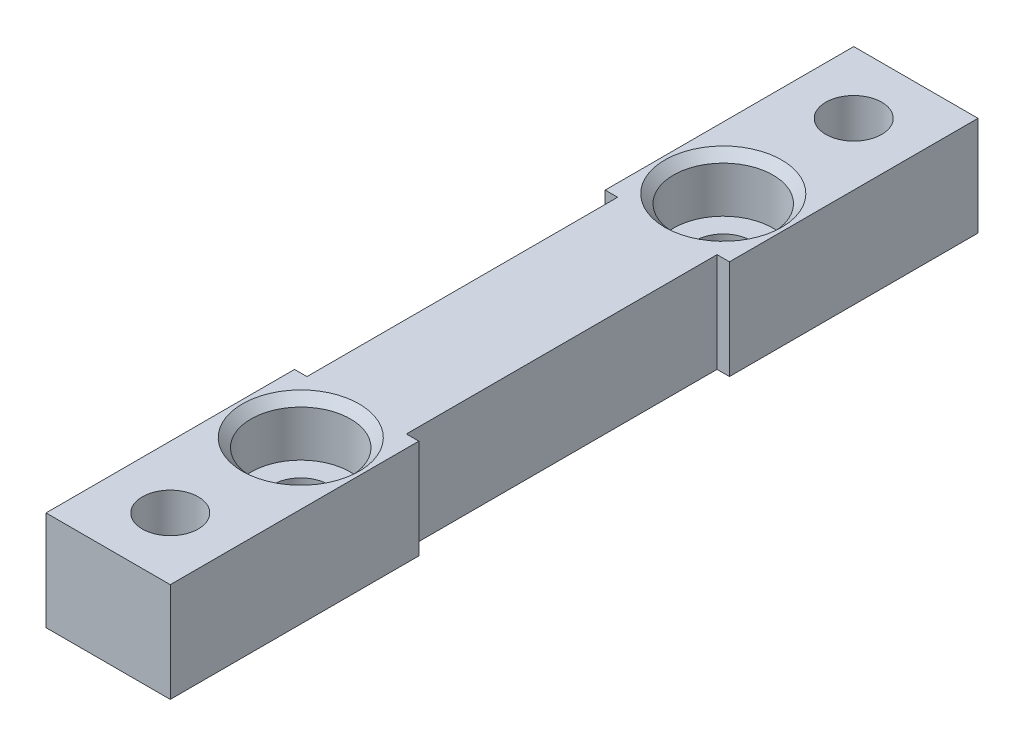
ISO-10303-21;
HEADER;
FILE_DESCRIPTION(('STEP AP214'),'2;1');
FILE_NAME('part.step','',(''),(''),'','','');
FILE_SCHEMA(('AUTOMOTIVE_DESIGN { 1 0 10303 214 1 1 1 1 }'));
ENDSEC;
DATA;
#1=APPLICATION_CONTEXT('core data for automotive mechanical design processes');
#2=APPLICATION_PROTOCOL_DEFINITION('international standard','automotive_design',2000,#1);
#3=PRODUCT_CONTEXT('',#1,'mechanical');
#4=PRODUCT('Part','Part','',(#3));
#5=PRODUCT_RELATED_PRODUCT_CATEGORY('part','',(#4));
#6=PRODUCT_DEFINITION_FORMATION('','',#4);
#7=PRODUCT_DEFINITION_CONTEXT('part definition',#1,'design');
#8=PRODUCT_DEFINITION('design','',#6,#7);
#9=PRODUCT_DEFINITION_SHAPE('','',#8);
#10=(LENGTH_UNIT() NAMED_UNIT(*) SI_UNIT(.MILLI.,.METRE.));
#11=(NAMED_UNIT(*) PLANE_ANGLE_UNIT() SI_UNIT($,.RADIAN.));
#12=(NAMED_UNIT(*) SI_UNIT($,.STERADIAN.) SOLID_ANGLE_UNIT());
#13=UNCERTAINTY_MEASURE_WITH_UNIT(LENGTH_MEASURE(1.E-05),#10,'distance_accuracy_value','');
#14=(GEOMETRIC_REPRESENTATION_CONTEXT(3) GLOBAL_UNCERTAINTY_ASSIGNED_CONTEXT((#13)) GLOBAL_UNIT_ASSIGNED_CONTEXT((#10,
#11,#12)) REPRESENTATION_CONTEXT('',''));
#15=CARTESIAN_POINT('',(0.,0.,0.));
#16=DIRECTION('',(0.,0.,1.));
#17=DIRECTION('',(1.,0.,0.));
#18=AXIS2_PLACEMENT_3D('',#15,#16,#17);
#19=CARTESIAN_POINT('',(0.,0.,0.));
#20=DIRECTION('',(0.,1.,0.));
#21=DIRECTION('',(0.,0.,1.));
#22=AXIS2_PLACEMENT_3D('',#19,#20,#21);
#23=PLANE('',#22);
#24=DIRECTION('',(-0.5,0.,0.866025403784438));
#25=VECTOR('',#24,1.);
#26=CARTESIAN_POINT('',(-8.83345911860128,0.,-5.10000000000001));
#27=LINE('',#26,#25);
#28=CARTESIAN_POINT('',(4.09918691124635,0.,-27.5));
#29=VERTEX_POINT('',#28);
#30=CARTESIAN_POINT('',(2.04959345562318,0.,-23.95));
#31=VERTEX_POINT('',#30);
#32=EDGE_CURVE('E231',#29,#31,#27,.T.);
#33=ORIENTED_EDGE('',*,*,#32,.F.);
#34=DIRECTION('',(0.5,0.,0.866025403784439));
#35=VECTOR('',#34,1.);
#36=CARTESIAN_POINT('',(14.9822394854708,0.,-8.65));
#37=LINE('',#36,#35);
#38=CARTESIAN_POINT('',(2.04959345562318,0.,-31.05));
#39=VERTEX_POINT('',#38);
#40=EDGE_CURVE('E49',#39,#29,#37,.T.);
#41=ORIENTED_EDGE('',*,*,#40,.F.);
#42=DIRECTION('',(1.,0.,0.));
#43=VECTOR('',#42,1.);
#44=CARTESIAN_POINT('',(0.,0.,-31.05));
#45=LINE('',#44,#43);
#46=CARTESIAN_POINT('',(-2.04959345562317,0.,-31.05));
#47=VERTEX_POINT('',#46);
#48=EDGE_CURVE('E220',#47,#39,#45,.T.);
#49=ORIENTED_EDGE('',*,*,#48,.F.);
#50=DIRECTION('',(0.5,0.,-0.866025403784438));
#51=VECTOR('',#50,1.);
#52=CARTESIAN_POINT('',(-14.9822394854708,0.,-8.65000000000001));
#53=LINE('',#52,#51);
#54=CARTESIAN_POINT('',(-4.09918691124634,0.,-27.5));
#55=VERTEX_POINT('',#54);
#56=EDGE_CURVE('E240',#55,#47,#53,.T.);
#57=ORIENTED_EDGE('',*,*,#56,.F.);
#58=DIRECTION('',(-0.5,0.,-0.866025403784439));
#59=VECTOR('',#58,1.);
#60=CARTESIAN_POINT('',(8.83345911860127,0.,-5.1));
#61=LINE('',#60,#59);
#62=CARTESIAN_POINT('',(-2.04959345562317,0.,-23.95));
#63=VERTEX_POINT('',#62);
#64=EDGE_CURVE('E237',#63,#55,#61,.T.);
#65=ORIENTED_EDGE('',*,*,#64,.F.);
#66=DIRECTION('',(-1.,0.,0.));
#67=VECTOR('',#66,1.);
#68=CARTESIAN_POINT('',(0.,0.,-23.95));
#69=LINE('',#68,#67);
#70=EDGE_CURVE('E234',#31,#63,#69,.T.);
#71=ORIENTED_EDGE('',*,*,#70,.F.);
#72=EDGE_LOOP('',(#33,#41,#49,#57,#65,#71));
#73=FACE_BOUND('',#72,.T.);
#74=DIRECTION('',(1.,0.,0.));
#75=VECTOR('',#74,1.);
#76=CARTESIAN_POINT('',(0.,0.,12.5));
#77=LINE('',#76,#75);
#78=CARTESIAN_POINT('',(4.,0.,12.5));
#79=VERTEX_POINT('',#78);
#80=CARTESIAN_POINT('',(5.00000000000001,0.,12.5));
#81=VERTEX_POINT('',#80);
#82=EDGE_CURVE('E333',#79,#81,#77,.T.);
#83=ORIENTED_EDGE('',*,*,#82,.T.);
#84=DIRECTION('',(0.,0.,-1.));
#85=VECTOR('',#84,1.);
#86=CARTESIAN_POINT('',(5.00000000000001,0.,0.));
#87=LINE('',#86,#85);
#88=CARTESIAN_POINT('',(5.,0.,32.5));
#89=VERTEX_POINT('',#88);
#90=EDGE_CURVE('E338',#89,#81,#87,.T.);
#91=ORIENTED_EDGE('',*,*,#90,.F.);
#92=DIRECTION('',(1.,0.,0.));
#93=VECTOR('',#92,1.);
#94=CARTESIAN_POINT('',(0.,0.,32.5));
#95=LINE('',#94,#93);
#96=CARTESIAN_POINT('',(-5.,0.,32.5));
#97=VERTEX_POINT('',#96);
#98=EDGE_CURVE('E387',#97,#89,#95,.T.);
#99=ORIENTED_EDGE('',*,*,#98,.F.);
#100=DIRECTION('',(0.,0.,-1.));
#101=VECTOR('',#100,1.);
#102=CARTESIAN_POINT('',(-5.,0.,0.));
#103=LINE('',#102,#101);
#104=CARTESIAN_POINT('',(-5.,0.,12.5));
#105=VERTEX_POINT('',#104);
#106=EDGE_CURVE('E384',#97,#105,#103,.T.);
#107=ORIENTED_EDGE('',*,*,#106,.T.);
#108=CARTESIAN_POINT('',(-4.,0.,12.5));
#109=VERTEX_POINT('',#108);
#110=EDGE_CURVE('E366',#105,#109,#77,.T.);
#111=ORIENTED_EDGE('',*,*,#110,.T.);
#112=DIRECTION('',(0.,0.,1.));
#113=VECTOR('',#112,1.);
#114=CARTESIAN_POINT('',(-4.,0.,0.));
#115=LINE('',#114,#113);
#116=CARTESIAN_POINT('',(-4.,0.,-12.5));
#117=VERTEX_POINT('',#116);
#118=EDGE_CURVE('E381',#117,#109,#115,.T.);
#119=ORIENTED_EDGE('',*,*,#118,.F.);
#120=DIRECTION('',(1.,0.,0.));
#121=VECTOR('',#120,1.);
#122=CARTESIAN_POINT('',(0.,0.,-12.5));
#123=LINE('',#122,#121);
#124=CARTESIAN_POINT('',(-5.,0.,-12.5));
#125=VERTEX_POINT('',#124);
#126=EDGE_CURVE('E373',#125,#117,#123,.T.);
#127=ORIENTED_EDGE('',*,*,#126,.F.);
#128=DIRECTION('',(0.,0.,1.));
#129=VECTOR('',#128,1.);
#130=CARTESIAN_POINT('',(-5.,0.,0.));
#131=LINE('',#130,#129);
#132=CARTESIAN_POINT('',(-5.,0.,-32.5));
#133=VERTEX_POINT('',#132);
#134=EDGE_CURVE('E379',#133,#125,#131,.T.);
#135=ORIENTED_EDGE('',*,*,#134,.F.);
#136=DIRECTION('',(1.,0.,0.));
#137=VECTOR('',#136,1.);
#138=CARTESIAN_POINT('',(0.,0.,-32.5));
#139=LINE('',#138,#137);
#140=CARTESIAN_POINT('',(5.,0.,-32.5));
#141=VERTEX_POINT('',#140);
#142=EDGE_CURVE('E376',#133,#141,#139,.T.);
#143=ORIENTED_EDGE('',*,*,#142,.T.);
#144=DIRECTION('',(0.,0.,1.));
#145=VECTOR('',#144,1.);
#146=CARTESIAN_POINT('',(5.00000000000001,0.,0.));
#147=LINE('',#146,#145);
#148=CARTESIAN_POINT('',(5.00000000000001,0.,-12.5));
#149=VERTEX_POINT('',#148);
#150=EDGE_CURVE('E372',#141,#149,#147,.T.);
#151=ORIENTED_EDGE('',*,*,#150,.T.);
#152=CARTESIAN_POINT('',(4.,0.,-12.5));
#153=VERTEX_POINT('',#152);
#154=EDGE_CURVE('E369',#153,#149,#123,.T.);
#155=ORIENTED_EDGE('',*,*,#154,.F.);
#156=DIRECTION('',(0.,0.,1.));
#157=VECTOR('',#156,1.);
#158=CARTESIAN_POINT('',(4.,0.,0.));
#159=LINE('',#158,#157);
#160=EDGE_CURVE('E365',#153,#79,#159,.T.);
#161=ORIENTED_EDGE('',*,*,#160,.T.);
#162=EDGE_LOOP('',(#83,#91,#99,#107,#111,#119,#127,#135,#143,#151,#155,#161));
#163=FACE_BOUND('',#162,.T.);
#164=CARTESIAN_POINT('',(0.,0.,17.));
#165=DIRECTION('',(0.,1.,0.));
#166=DIRECTION('',(0.,0.,1.));
#167=AXIS2_PLACEMENT_3D('',#164,#165,#166);
#168=CIRCLE('',#167,2.25);
#169=CARTESIAN_POINT('',(0.,0.,19.25));
#170=VERTEX_POINT('',#169);
#171=EDGE_CURVE('E330',#170,#170,#168,.T.);
#172=ORIENTED_EDGE('',*,*,#171,.T.);
#173=EDGE_LOOP('',(#172));
#174=FACE_BOUND('',#173,.T.);
#175=CARTESIAN_POINT('',(0.,0.,-17.));
#176=DIRECTION('',(0.,1.,0.));
#177=DIRECTION('',(0.,0.,1.));
#178=AXIS2_PLACEMENT_3D('',#175,#176,#177);
#179=CIRCLE('',#178,2.25);
#180=CARTESIAN_POINT('',(0.,0.,-14.75));
#181=VERTEX_POINT('',#180);
#182=EDGE_CURVE('E315',#181,#181,#179,.T.);
#183=ORIENTED_EDGE('',*,*,#182,.T.);
#184=EDGE_LOOP('',(#183));
#185=FACE_BOUND('',#184,.T.);
#186=DIRECTION('',(-1.,0.,0.));
#187=VECTOR('',#186,1.);
#188=CARTESIAN_POINT('',(0.,0.,23.95));
#189=LINE('',#188,#187);
#190=CARTESIAN_POINT('',(2.04959345562317,0.,23.95));
#191=VERTEX_POINT('',#190);
#192=CARTESIAN_POINT('',(-2.04959345562317,0.,23.95));
#193=VERTEX_POINT('',#192);
#194=EDGE_CURVE('E57',#191,#193,#189,.T.);
#195=ORIENTED_EDGE('',*,*,#194,.T.);
#196=DIRECTION('',(-0.5,0.,0.866025403784439));
#197=VECTOR('',#196,1.);
#198=CARTESIAN_POINT('',(8.83345911860127,0.,5.1));
#199=LINE('',#198,#197);
#200=CARTESIAN_POINT('',(-4.09918691124635,0.,27.5));
#201=VERTEX_POINT('',#200);
#202=EDGE_CURVE('E259',#193,#201,#199,.T.);
#203=ORIENTED_EDGE('',*,*,#202,.T.);
#204=DIRECTION('',(0.5,0.,0.866025403784438));
#205=VECTOR('',#204,1.);
#206=CARTESIAN_POINT('',(-14.9822394854708,0.,8.65000000000001));
#207=LINE('',#206,#205);
#208=CARTESIAN_POINT('',(-2.04959345562317,0.,31.05));
#209=VERTEX_POINT('',#208);
#210=EDGE_CURVE('E283',#201,#209,#207,.T.);
#211=ORIENTED_EDGE('',*,*,#210,.T.);
#212=DIRECTION('',(1.,0.,0.));
#213=VECTOR('',#212,1.);
#214=CARTESIAN_POINT('',(0.,0.,31.05));
#215=LINE('',#214,#213);
#216=CARTESIAN_POINT('',(2.04959345562318,0.,31.05));
#217=VERTEX_POINT('',#216);
#218=EDGE_CURVE('E280',#209,#217,#215,.T.);
#219=ORIENTED_EDGE('',*,*,#218,.T.);
#220=DIRECTION('',(0.5,0.,-0.866025403784439));
#221=VECTOR('',#220,1.);
#222=CARTESIAN_POINT('',(14.9822394854708,0.,8.65));
#223=LINE('',#222,#221);
#224=CARTESIAN_POINT('',(4.09918691124635,0.,27.5));
#225=VERTEX_POINT('',#224);
#226=EDGE_CURVE('E277',#217,#225,#223,.T.);
#227=ORIENTED_EDGE('',*,*,#226,.T.);
#228=DIRECTION('',(-0.5,0.,-0.866025403784438));
#229=VECTOR('',#228,1.);
#230=CARTESIAN_POINT('',(-8.83345911860128,0.,5.10000000000001));
#231=LINE('',#230,#229);
#232=EDGE_CURVE('E274',#225,#191,#231,.T.);
#233=ORIENTED_EDGE('',*,*,#232,.T.);
#234=EDGE_LOOP('',(#195,#203,#211,#219,#227,#233));
#235=FACE_BOUND('',#234,.T.);
#236=ADVANCED_FACE('F34',(#73,#163,#174,#185,#235),#23,.F.);
#237=CARTESIAN_POINT('',(0.,0.,-27.5));
#238=DIRECTION('',(0.,-1.,0.));
#239=DIRECTION('',(0.,0.,-1.));
#240=AXIS2_PLACEMENT_3D('',#237,#238,#239);
#241=CYLINDRICAL_SURFACE('',#240,2.25);
#242=CARTESIAN_POINT('',(0.,8.,-27.5));
#243=DIRECTION('',(0.,1.,0.));
#244=DIRECTION('',(0.,0.,1.));
#245=AXIS2_PLACEMENT_3D('',#242,#243,#244);
#246=CIRCLE('',#245,2.25);
#247=CARTESIAN_POINT('',(0.,8.,-25.25));
#248=VERTEX_POINT('',#247);
#249=EDGE_CURVE('E300',#248,#248,#246,.T.);
#250=ORIENTED_EDGE('',*,*,#249,.T.);
#251=EDGE_LOOP('',(#250));
#252=FACE_BOUND('',#251,.T.);
#253=CARTESIAN_POINT('',(0.,4.,-27.5));
#254=DIRECTION('',(0.,-1.,0.));
#255=DIRECTION('',(0.,0.,-1.));
#256=AXIS2_PLACEMENT_3D('',#253,#254,#255);
#257=CIRCLE('',#256,2.25);
#258=CARTESIAN_POINT('',(0.,4.,-29.75));
#259=VERTEX_POINT('',#258);
#260=EDGE_CURVE('E217',#259,#259,#257,.F.);
#261=ORIENTED_EDGE('',*,*,#260,.F.);
#262=EDGE_LOOP('',(#261));
#263=FACE_BOUND('',#262,.T.);
#264=ADVANCED_FACE('F480',(#252,#263),#241,.F.);
#265=CARTESIAN_POINT('',(0.,0.,27.5));
#266=DIRECTION('',(0.,-1.,0.));
#267=DIRECTION('',(0.,0.,-1.));
#268=AXIS2_PLACEMENT_3D('',#265,#266,#267);
#269=CYLINDRICAL_SURFACE('',#268,2.25);
#270=CARTESIAN_POINT('',(0.,8.,27.5));
#271=DIRECTION('',(0.,1.,0.));
#272=DIRECTION('',(0.,0.,1.));
#273=AXIS2_PLACEMENT_3D('',#270,#271,#272);
#274=CIRCLE('',#273,2.25);
#275=CARTESIAN_POINT('',(0.,8.,29.75));
#276=VERTEX_POINT('',#275);
#277=EDGE_CURVE('E247',#276,#276,#274,.T.);
#278=ORIENTED_EDGE('',*,*,#277,.T.);
#279=EDGE_LOOP('',(#278));
#280=FACE_BOUND('',#279,.T.);
#281=CARTESIAN_POINT('',(0.,4.,27.5));
#282=DIRECTION('',(0.,-1.,0.));
#283=DIRECTION('',(0.,0.,-1.));
#284=AXIS2_PLACEMENT_3D('',#281,#282,#283);
#285=CIRCLE('',#284,2.25);
#286=CARTESIAN_POINT('',(0.,4.,25.25));
#287=VERTEX_POINT('',#286);
#288=EDGE_CURVE('E269',#287,#287,#285,.F.);
#289=ORIENTED_EDGE('',*,*,#288,.F.);
#290=EDGE_LOOP('',(#289));
#291=FACE_BOUND('',#290,.T.);
#292=ADVANCED_FACE('F486',(#280,#291),#269,.F.);
#293=CARTESIAN_POINT('',(0.,8.,12.5));
#294=DIRECTION('',(0.,0.,-1.));
#295=DIRECTION('',(-1.,0.,0.));
#296=AXIS2_PLACEMENT_3D('',#293,#294,#295);
#297=PLANE('',#296);
#298=ORIENTED_EDGE('',*,*,#82,.F.);
#299=DIRECTION('',(0.,-1.,0.));
#300=VECTOR('',#299,1.);
#301=CARTESIAN_POINT('',(4.,8.,12.5));
#302=LINE('',#301,#300);
#303=CARTESIAN_POINT('',(4.,8.,12.5));
#304=VERTEX_POINT('',#303);
#305=EDGE_CURVE('E11',#304,#79,#302,.T.);
#306=ORIENTED_EDGE('',*,*,#305,.F.);
#307=DIRECTION('',(1.,0.,0.));
#308=VECTOR('',#307,1.);
#309=CARTESIAN_POINT('',(0.,8.,12.5));
#310=LINE('',#309,#308);
#311=CARTESIAN_POINT('',(5.00000000000001,8.,12.5));
#312=VERTEX_POINT('',#311);
#313=EDGE_CURVE('E334',#304,#312,#310,.T.);
#314=ORIENTED_EDGE('',*,*,#313,.T.);
#315=DIRECTION('',(0.,-1.,0.));
#316=VECTOR('',#315,1.);
#317=CARTESIAN_POINT('',(5.00000000000001,8.,12.5));
#318=LINE('',#317,#316);
#319=EDGE_CURVE('E362',#312,#81,#318,.T.);
#320=ORIENTED_EDGE('',*,*,#319,.T.);
#321=EDGE_LOOP('',(#298,#306,#314,#320));
#322=FACE_BOUND('',#321,.T.);
#323=ADVANCED_FACE('F426',(#322),#297,.T.);
#324=CARTESIAN_POINT('',(4.,8.,0.));
#325=DIRECTION('',(1.,0.,0.));
#326=DIRECTION('',(0.,0.,-1.));
#327=AXIS2_PLACEMENT_3D('',#324,#325,#326);
#328=PLANE('',#327);
#329=ORIENTED_EDGE('',*,*,#160,.F.);
#330=DIRECTION('',(0.,-1.,0.));
#331=VECTOR('',#330,1.);
#332=CARTESIAN_POINT('',(4.,8.,-12.5));
#333=LINE('',#332,#331);
#334=CARTESIAN_POINT('',(4.,8.,-12.5));
#335=VERTEX_POINT('',#334);
#336=EDGE_CURVE('E42',#335,#153,#333,.T.);
#337=ORIENTED_EDGE('',*,*,#336,.F.);
#338=DIRECTION('',(0.,0.,1.));
#339=VECTOR('',#338,1.);
#340=CARTESIAN_POINT('',(4.,8.,0.));
#341=LINE('',#340,#339);
#342=EDGE_CURVE('E337',#335,#304,#341,.T.);
#343=ORIENTED_EDGE('',*,*,#342,.T.);
#344=ORIENTED_EDGE('',*,*,#305,.T.);
#345=EDGE_LOOP('',(#329,#337,#343,#344));
#346=FACE_BOUND('',#345,.T.);
#347=ADVANCED_FACE('F36',(#346),#328,.T.);
#348=CARTESIAN_POINT('',(0.,8.,-12.5));
#349=DIRECTION('',(0.,0.,-1.));
#350=DIRECTION('',(-1.,0.,0.));
#351=AXIS2_PLACEMENT_3D('',#348,#349,#350);
#352=PLANE('',#351);
#353=ORIENTED_EDGE('',*,*,#154,.T.);
#354=DIRECTION('',(0.,-1.,0.));
#355=VECTOR('',#354,1.);
#356=CARTESIAN_POINT('',(5.00000000000001,8.,-12.5));
#357=LINE('',#356,#355);
#358=CARTESIAN_POINT('',(5.00000000000001,8.,-12.5));
#359=VERTEX_POINT('',#358);
#360=EDGE_CURVE('E411',#359,#149,#357,.T.);
#361=ORIENTED_EDGE('',*,*,#360,.F.);
#362=DIRECTION('',(1.,0.,0.));
#363=VECTOR('',#362,1.);
#364=CARTESIAN_POINT('',(0.,8.,-12.5));
#365=LINE('',#364,#363);
#366=EDGE_CURVE('E342',#335,#359,#365,.T.);
#367=ORIENTED_EDGE('',*,*,#366,.F.);
#368=ORIENTED_EDGE('',*,*,#336,.T.);
#369=EDGE_LOOP('',(#353,#361,#367,#368));
#370=FACE_BOUND('',#369,.T.);
#371=ADVANCED_FACE('F415',(#370),#352,.F.);
#372=CARTESIAN_POINT('',(5.00000000000001,8.,0.));
#373=DIRECTION('',(1.,0.,0.));
#374=DIRECTION('',(0.,0.,-1.));
#375=AXIS2_PLACEMENT_3D('',#372,#373,#374);
#376=PLANE('',#375);
#377=ORIENTED_EDGE('',*,*,#150,.F.);
#378=DIRECTION('',(0.,-1.,0.));
#379=VECTOR('',#378,1.);
#380=CARTESIAN_POINT('',(5.,8.,-32.5));
#381=LINE('',#380,#379);
#382=CARTESIAN_POINT('',(5.,8.,-32.5));
#383=VERTEX_POINT('',#382);
#384=EDGE_CURVE('E409',#383,#141,#381,.T.);
#385=ORIENTED_EDGE('',*,*,#384,.F.);
#386=DIRECTION('',(0.,0.,1.));
#387=VECTOR('',#386,1.);
#388=CARTESIAN_POINT('',(5.00000000000001,8.,0.));
#389=LINE('',#388,#387);
#390=EDGE_CURVE('E344',#383,#359,#389,.T.);
#391=ORIENTED_EDGE('',*,*,#390,.T.);
#392=ORIENTED_EDGE('',*,*,#360,.T.);
#393=EDGE_LOOP('',(#377,#385,#391,#392));
#394=FACE_BOUND('',#393,.T.);
#395=ADVANCED_FACE('F467',(#394),#376,.T.);
#396=CARTESIAN_POINT('',(0.,8.,-32.5));
#397=DIRECTION('',(0.,0.,-1.));
#398=DIRECTION('',(-1.,0.,0.));
#399=AXIS2_PLACEMENT_3D('',#396,#397,#398);
#400=PLANE('',#399);
#401=ORIENTED_EDGE('',*,*,#142,.F.);
#402=DIRECTION('',(0.,-1.,0.));
#403=VECTOR('',#402,1.);
#404=CARTESIAN_POINT('',(-5.,8.,-32.5));
#405=LINE('',#404,#403);
#406=CARTESIAN_POINT('',(-5.,8.,-32.5));
#407=VERTEX_POINT('',#406);
#408=EDGE_CURVE('E407',#407,#133,#405,.T.);
#409=ORIENTED_EDGE('',*,*,#408,.F.);
#410=DIRECTION('',(1.,0.,0.));
#411=VECTOR('',#410,1.);
#412=CARTESIAN_POINT('',(0.,8.,-32.5));
#413=LINE('',#412,#411);
#414=EDGE_CURVE('E348',#407,#383,#413,.T.);
#415=ORIENTED_EDGE('',*,*,#414,.T.);
#416=ORIENTED_EDGE('',*,*,#384,.T.);
#417=EDGE_LOOP('',(#401,#409,#415,#416));
#418=FACE_BOUND('',#417,.T.);
#419=ADVANCED_FACE('F462',(#418),#400,.T.);
#420=CARTESIAN_POINT('',(-5.,8.,0.));
#421=DIRECTION('',(1.,0.,0.));
#422=DIRECTION('',(0.,0.,-1.));
#423=AXIS2_PLACEMENT_3D('',#420,#421,#422);
#424=PLANE('',#423);
#425=ORIENTED_EDGE('',*,*,#134,.T.);
#426=DIRECTION('',(0.,-1.,0.));
#427=VECTOR('',#426,1.);
#428=CARTESIAN_POINT('',(-5.,8.,-12.5));
#429=LINE('',#428,#427);
#430=CARTESIAN_POINT('',(-5.,8.,-12.5));
#431=VERTEX_POINT('',#430);
#432=EDGE_CURVE('E404',#431,#125,#429,.T.);
#433=ORIENTED_EDGE('',*,*,#432,.F.);
#434=DIRECTION('',(0.,0.,1.));
#435=VECTOR('',#434,1.);
#436=CARTESIAN_POINT('',(-5.,8.,0.));
#437=LINE('',#436,#435);
#438=EDGE_CURVE('E351',#407,#431,#437,.T.);
#439=ORIENTED_EDGE('',*,*,#438,.F.);
#440=ORIENTED_EDGE('',*,*,#408,.T.);
#441=EDGE_LOOP('',(#425,#433,#439,#440));
#442=FACE_BOUND('',#441,.T.);
#443=ADVANCED_FACE('F470',(#442),#424,.F.);
#444=ORIENTED_EDGE('',*,*,#126,.T.);
#445=DIRECTION('',(0.,-1.,0.));
#446=VECTOR('',#445,1.);
#447=CARTESIAN_POINT('',(-4.,8.,-12.5));
#448=LINE('',#447,#446);
#449=CARTESIAN_POINT('',(-4.,8.,-12.5));
#450=VERTEX_POINT('',#449);
#451=EDGE_CURVE('E401',#450,#117,#448,.T.);
#452=ORIENTED_EDGE('',*,*,#451,.F.);
#453=EDGE_CURVE('E345',#431,#450,#365,.T.);
#454=ORIENTED_EDGE('',*,*,#453,.F.);
#455=ORIENTED_EDGE('',*,*,#432,.T.);
#456=EDGE_LOOP('',(#444,#452,#454,#455));
#457=FACE_BOUND('',#456,.T.);
#458=ADVANCED_FACE('F456',(#457),#352,.F.);
#459=CARTESIAN_POINT('',(-4.,8.,0.));
#460=DIRECTION('',(1.,0.,0.));
#461=DIRECTION('',(0.,0.,-1.));
#462=AXIS2_PLACEMENT_3D('',#459,#460,#461);
#463=PLANE('',#462);
#464=ORIENTED_EDGE('',*,*,#118,.T.);
#465=DIRECTION('',(0.,-1.,0.));
#466=VECTOR('',#465,1.);
#467=CARTESIAN_POINT('',(-4.,8.,12.5));
#468=LINE('',#467,#466);
#469=CARTESIAN_POINT('',(-4.,8.,12.5));
#470=VERTEX_POINT('',#469);
#471=EDGE_CURVE('E399',#470,#109,#468,.T.);
#472=ORIENTED_EDGE('',*,*,#471,.F.);
#473=DIRECTION('',(0.,0.,1.));
#474=VECTOR('',#473,1.);
#475=CARTESIAN_POINT('',(-4.,8.,0.));
#476=LINE('',#475,#474);
#477=EDGE_CURVE('E353',#450,#470,#476,.T.);
#478=ORIENTED_EDGE('',*,*,#477,.F.);
#479=ORIENTED_EDGE('',*,*,#451,.T.);
#480=EDGE_LOOP('',(#464,#472,#478,#479));
#481=FACE_BOUND('',#480,.T.);
#482=ADVANCED_FACE('F452',(#481),#463,.F.);
#483=ORIENTED_EDGE('',*,*,#110,.F.);
#484=DIRECTION('',(0.,-1.,0.));
#485=VECTOR('',#484,1.);
#486=CARTESIAN_POINT('',(-5.,8.,12.5));
#487=LINE('',#486,#485);
#488=CARTESIAN_POINT('',(-5.,8.,12.5));
#489=VERTEX_POINT('',#488);
#490=EDGE_CURVE('E397',#489,#105,#487,.T.);
#491=ORIENTED_EDGE('',*,*,#490,.F.);
#492=EDGE_CURVE('E339',#489,#470,#310,.T.);
#493=ORIENTED_EDGE('',*,*,#492,.T.);
#494=ORIENTED_EDGE('',*,*,#471,.T.);
#495=EDGE_LOOP('',(#483,#491,#493,#494));
#496=FACE_BOUND('',#495,.T.);
#497=ADVANCED_FACE('F446',(#496),#297,.T.);
#498=CARTESIAN_POINT('',(-5.,8.,0.));
#499=DIRECTION('',(-1.,0.,0.));
#500=DIRECTION('',(0.,0.,1.));
#501=AXIS2_PLACEMENT_3D('',#498,#499,#500);
#502=PLANE('',#501);
#503=ORIENTED_EDGE('',*,*,#106,.F.);
#504=DIRECTION('',(0.,-1.,0.));
#505=VECTOR('',#504,1.);
#506=CARTESIAN_POINT('',(-5.,8.,32.5));
#507=LINE('',#506,#505);
#508=CARTESIAN_POINT('',(-5.,8.,32.5));
#509=VERTEX_POINT('',#508);
#510=EDGE_CURVE('E395',#509,#97,#507,.T.);
#511=ORIENTED_EDGE('',*,*,#510,.F.);
#512=DIRECTION('',(0.,0.,-1.));
#513=VECTOR('',#512,1.);
#514=CARTESIAN_POINT('',(-5.,8.,0.));
#515=LINE('',#514,#513);
#516=EDGE_CURVE('E355',#509,#489,#515,.T.);
#517=ORIENTED_EDGE('',*,*,#516,.T.);
#518=ORIENTED_EDGE('',*,*,#490,.T.);
#519=EDGE_LOOP('',(#503,#511,#517,#518));
#520=FACE_BOUND('',#519,.T.);
#521=ADVANCED_FACE('F440',(#520),#502,.T.);
#522=CARTESIAN_POINT('',(0.,8.,32.5));
#523=DIRECTION('',(0.,0.,-1.));
#524=DIRECTION('',(-1.,0.,0.));
#525=AXIS2_PLACEMENT_3D('',#522,#523,#524);
#526=PLANE('',#525);
#527=ORIENTED_EDGE('',*,*,#98,.T.);
#528=DIRECTION('',(0.,-1.,0.));
#529=VECTOR('',#528,1.);
#530=CARTESIAN_POINT('',(5.,8.,32.5));
#531=LINE('',#530,#529);
#532=CARTESIAN_POINT('',(5.,8.,32.5));
#533=VERTEX_POINT('',#532);
#534=EDGE_CURVE('E392',#533,#89,#531,.T.);
#535=ORIENTED_EDGE('',*,*,#534,.F.);
#536=DIRECTION('',(1.,0.,0.));
#537=VECTOR('',#536,1.);
#538=CARTESIAN_POINT('',(0.,8.,32.5));
#539=LINE('',#538,#537);
#540=EDGE_CURVE('E358',#509,#533,#539,.T.);
#541=ORIENTED_EDGE('',*,*,#540,.F.);
#542=ORIENTED_EDGE('',*,*,#510,.T.);
#543=EDGE_LOOP('',(#527,#535,#541,#542));
#544=FACE_BOUND('',#543,.T.);
#545=ADVANCED_FACE('F437',(#544),#526,.F.);
#546=CARTESIAN_POINT('',(5.00000000000001,8.,0.));
#547=DIRECTION('',(-1.,0.,0.));
#548=DIRECTION('',(0.,0.,1.));
#549=AXIS2_PLACEMENT_3D('',#546,#547,#548);
#550=PLANE('',#549);
#551=ORIENTED_EDGE('',*,*,#90,.T.);
#552=ORIENTED_EDGE('',*,*,#319,.F.);
#553=DIRECTION('',(0.,0.,-1.));
#554=VECTOR('',#553,1.);
#555=CARTESIAN_POINT('',(5.00000000000001,8.,0.));
#556=LINE('',#555,#554);
#557=EDGE_CURVE('E360',#533,#312,#556,.T.);
#558=ORIENTED_EDGE('',*,*,#557,.F.);
#559=ORIENTED_EDGE('',*,*,#534,.T.);
#560=EDGE_LOOP('',(#551,#552,#558,#559));
#561=FACE_BOUND('',#560,.T.);
#562=ADVANCED_FACE('F432',(#561),#550,.F.);
#563=CARTESIAN_POINT('',(0.,8.,0.));
#564=DIRECTION('',(0.,1.,0.));
#565=DIRECTION('',(0.,0.,1.));
#566=AXIS2_PLACEMENT_3D('',#563,#564,#565);
#567=PLANE('',#566);
#568=ORIENTED_EDGE('',*,*,#277,.F.);
#569=EDGE_LOOP('',(#568));
#570=FACE_BOUND('',#569,.T.);
#571=ORIENTED_EDGE('',*,*,#249,.F.);
#572=EDGE_LOOP('',(#571));
#573=FACE_BOUND('',#572,.T.);
#574=CARTESIAN_POINT('',(0.,8.,-17.));
#575=DIRECTION('',(0.,1.,0.));
#576=DIRECTION('',(0.,0.,1.));
#577=AXIS2_PLACEMENT_3D('',#574,#575,#576);
#578=CIRCLE('',#577,4.7);
#579=CARTESIAN_POINT('',(0.,8.,-12.3));
#580=VERTEX_POINT('',#579);
#581=EDGE_CURVE('E303',#580,#580,#578,.T.);
#582=ORIENTED_EDGE('',*,*,#581,.F.);
#583=EDGE_LOOP('',(#582));
#584=FACE_BOUND('',#583,.T.);
#585=CARTESIAN_POINT('',(0.,8.,17.));
#586=DIRECTION('',(0.,1.,0.));
#587=DIRECTION('',(0.,0.,1.));
#588=AXIS2_PLACEMENT_3D('',#585,#586,#587);
#589=CIRCLE('',#588,4.7);
#590=CARTESIAN_POINT('',(0.,8.,21.7));
#591=VERTEX_POINT('',#590);
#592=EDGE_CURVE('E318',#591,#591,#589,.T.);
#593=ORIENTED_EDGE('',*,*,#592,.F.);
#594=EDGE_LOOP('',(#593));
#595=FACE_BOUND('',#594,.T.);
#596=ORIENTED_EDGE('',*,*,#313,.F.);
#597=ORIENTED_EDGE('',*,*,#342,.F.);
#598=ORIENTED_EDGE('',*,*,#366,.T.);
#599=ORIENTED_EDGE('',*,*,#390,.F.);
#600=ORIENTED_EDGE('',*,*,#414,.F.);
#601=ORIENTED_EDGE('',*,*,#438,.T.);
#602=ORIENTED_EDGE('',*,*,#453,.T.);
#603=ORIENTED_EDGE('',*,*,#477,.T.);
#604=ORIENTED_EDGE('',*,*,#492,.F.);
#605=ORIENTED_EDGE('',*,*,#516,.F.);
#606=ORIENTED_EDGE('',*,*,#540,.T.);
#607=ORIENTED_EDGE('',*,*,#557,.T.);
#608=EDGE_LOOP('',(#596,#597,#598,#599,#600,#601,#602,#603,#604,#605,#606,#607));
#609=FACE_BOUND('',#608,.T.);
#610=ADVANCED_FACE('F469',(#570,#573,#584,#595,#609),#567,.T.);
#611=CARTESIAN_POINT('',(0.,8.,17.));
#612=DIRECTION('',(0.,1.,0.));
#613=DIRECTION('',(0.,0.,1.));
#614=AXIS2_PLACEMENT_3D('',#611,#612,#613);
#615=CYLINDRICAL_SURFACE('',#614,2.25);
#616=ORIENTED_EDGE('',*,*,#171,.F.);
#617=EDGE_LOOP('',(#616));
#618=FACE_BOUND('',#617,.T.);
#619=CARTESIAN_POINT('',(0.,3.6,17.));
#620=DIRECTION('',(0.,1.,0.));
#621=DIRECTION('',(0.,0.,1.));
#622=AXIS2_PLACEMENT_3D('',#619,#620,#621);
#623=CIRCLE('',#622,2.25);
#624=CARTESIAN_POINT('',(0.,3.6,19.25));
#625=VERTEX_POINT('',#624);
#626=EDGE_CURVE('E327',#625,#625,#623,.T.);
#627=ORIENTED_EDGE('',*,*,#626,.T.);
#628=EDGE_LOOP('',(#627));
#629=FACE_BOUND('',#628,.T.);
#630=ADVANCED_FACE('F528',(#618,#629),#615,.F.);
#631=CARTESIAN_POINT('',(4.00000000000001,3.6,17.));
#632=DIRECTION('',(0.,-1.,0.));
#633=DIRECTION('',(0.,0.,-1.));
#634=AXIS2_PLACEMENT_3D('',#631,#632,#633);
#635=PLANE('',#634);
#636=ORIENTED_EDGE('',*,*,#626,.F.);
#637=EDGE_LOOP('',(#636));
#638=FACE_BOUND('',#637,.T.);
#639=CARTESIAN_POINT('',(0.,3.6,17.));
#640=DIRECTION('',(0.,1.,0.));
#641=DIRECTION('',(0.,0.,1.));
#642=AXIS2_PLACEMENT_3D('',#639,#640,#641);
#643=CIRCLE('',#642,4.);
#644=CARTESIAN_POINT('',(0.,3.6,21.));
#645=VERTEX_POINT('',#644);
#646=EDGE_CURVE('E324',#645,#645,#643,.T.);
#647=ORIENTED_EDGE('',*,*,#646,.T.);
#648=EDGE_LOOP('',(#647));
#649=FACE_BOUND('',#648,.T.);
#650=ADVANCED_FACE('F535',(#638,#649),#635,.F.);
#651=CARTESIAN_POINT('',(0.,8.,17.));
#652=DIRECTION('',(0.,1.,0.));
#653=DIRECTION('',(0.,0.,1.));
#654=AXIS2_PLACEMENT_3D('',#651,#652,#653);
#655=CYLINDRICAL_SURFACE('',#654,4.);
#656=ORIENTED_EDGE('',*,*,#646,.F.);
#657=EDGE_LOOP('',(#656));
#658=FACE_BOUND('',#657,.T.);
#659=CARTESIAN_POINT('',(0.,7.3,17.));
#660=DIRECTION('',(0.,1.,0.));
#661=DIRECTION('',(0.,0.,1.));
#662=AXIS2_PLACEMENT_3D('',#659,#660,#661);
#663=CIRCLE('',#662,4.);
#664=CARTESIAN_POINT('',(0.,7.3,21.));
#665=VERTEX_POINT('',#664);
#666=EDGE_CURVE('E321',#665,#665,#663,.T.);
#667=ORIENTED_EDGE('',*,*,#666,.T.);
#668=EDGE_LOOP('',(#667));
#669=FACE_BOUND('',#668,.T.);
#670=ADVANCED_FACE('F542',(#658,#669),#655,.F.);
#671=CARTESIAN_POINT('',(0.,8.,17.));
#672=DIRECTION('',(0.,1.,0.));
#673=DIRECTION('',(0.,0.,1.));
#674=AXIS2_PLACEMENT_3D('',#671,#672,#673);
#675=CONICAL_SURFACE('',#674,4.7,0.785398163397445);
#676=ORIENTED_EDGE('',*,*,#666,.F.);
#677=EDGE_LOOP('',(#676));
#678=FACE_BOUND('',#677,.T.);
#679=ORIENTED_EDGE('',*,*,#592,.T.);
#680=EDGE_LOOP('',(#679));
#681=FACE_BOUND('',#680,.T.);
#682=ADVANCED_FACE('F550',(#678,#681),#675,.F.);
#683=CARTESIAN_POINT('',(0.,8.,-17.));
#684=DIRECTION('',(0.,1.,0.));
#685=DIRECTION('',(0.,0.,1.));
#686=AXIS2_PLACEMENT_3D('',#683,#684,#685);
#687=CYLINDRICAL_SURFACE('',#686,2.25);
#688=ORIENTED_EDGE('',*,*,#182,.F.);
#689=EDGE_LOOP('',(#688));
#690=FACE_BOUND('',#689,.T.);
#691=CARTESIAN_POINT('',(0.,3.6,-17.));
#692=DIRECTION('',(0.,1.,0.));
#693=DIRECTION('',(0.,0.,1.));
#694=AXIS2_PLACEMENT_3D('',#691,#692,#693);
#695=CIRCLE('',#694,2.25);
#696=CARTESIAN_POINT('',(0.,3.6,-14.75));
#697=VERTEX_POINT('',#696);
#698=EDGE_CURVE('E312',#697,#697,#695,.T.);
#699=ORIENTED_EDGE('',*,*,#698,.T.);
#700=EDGE_LOOP('',(#699));
#701=FACE_BOUND('',#700,.T.);
#702=ADVANCED_FACE('F558',(#690,#701),#687,.F.);
#703=CARTESIAN_POINT('',(4.00000000000001,3.6,-17.));
#704=DIRECTION('',(0.,-1.,0.));
#705=DIRECTION('',(0.,0.,-1.));
#706=AXIS2_PLACEMENT_3D('',#703,#704,#705);
#707=PLANE('',#706);
#708=ORIENTED_EDGE('',*,*,#698,.F.);
#709=EDGE_LOOP('',(#708));
#710=FACE_BOUND('',#709,.T.);
#711=CARTESIAN_POINT('',(0.,3.6,-17.));
#712=DIRECTION('',(0.,1.,0.));
#713=DIRECTION('',(0.,0.,1.));
#714=AXIS2_PLACEMENT_3D('',#711,#712,#713);
#715=CIRCLE('',#714,4.);
#716=CARTESIAN_POINT('',(0.,3.6,-13.));
#717=VERTEX_POINT('',#716);
#718=EDGE_CURVE('E309',#717,#717,#715,.T.);
#719=ORIENTED_EDGE('',*,*,#718,.T.);
#720=EDGE_LOOP('',(#719));
#721=FACE_BOUND('',#720,.T.);
#722=ADVANCED_FACE('F566',(#710,#721),#707,.F.);
#723=CARTESIAN_POINT('',(0.,8.,-17.));
#724=DIRECTION('',(0.,1.,0.));
#725=DIRECTION('',(0.,0.,1.));
#726=AXIS2_PLACEMENT_3D('',#723,#724,#725);
#727=CYLINDRICAL_SURFACE('',#726,4.);
#728=ORIENTED_EDGE('',*,*,#718,.F.);
#729=EDGE_LOOP('',(#728));
#730=FACE_BOUND('',#729,.T.);
#731=CARTESIAN_POINT('',(0.,7.3,-17.));
#732=DIRECTION('',(0.,1.,0.));
#733=DIRECTION('',(0.,0.,1.));
#734=AXIS2_PLACEMENT_3D('',#731,#732,#733);
#735=CIRCLE('',#734,4.);
#736=CARTESIAN_POINT('',(0.,7.3,-13.));
#737=VERTEX_POINT('',#736);
#738=EDGE_CURVE('E306',#737,#737,#735,.T.);
#739=ORIENTED_EDGE('',*,*,#738,.T.);
#740=EDGE_LOOP('',(#739));
#741=FACE_BOUND('',#740,.T.);
#742=ADVANCED_FACE('F574',(#730,#741),#727,.F.);
#743=CARTESIAN_POINT('',(0.,8.,-17.));
#744=DIRECTION('',(0.,1.,0.));
#745=DIRECTION('',(0.,0.,1.));
#746=AXIS2_PLACEMENT_3D('',#743,#744,#745);
#747=CONICAL_SURFACE('',#746,4.7,0.785398163397445);
#748=ORIENTED_EDGE('',*,*,#738,.F.);
#749=EDGE_LOOP('',(#748));
#750=FACE_BOUND('',#749,.T.);
#751=ORIENTED_EDGE('',*,*,#581,.T.);
#752=EDGE_LOOP('',(#751));
#753=FACE_BOUND('',#752,.T.);
#754=ADVANCED_FACE('F582',(#750,#753),#747,.F.);
#755=CARTESIAN_POINT('',(0.,4.,23.95));
#756=DIRECTION('',(0.,0.,1.));
#757=DIRECTION('',(1.,0.,0.));
#758=AXIS2_PLACEMENT_3D('',#755,#756,#757);
#759=PLANE('',#758);
#760=ORIENTED_EDGE('',*,*,#194,.F.);
#761=DIRECTION('',(0.,-1.,0.));
#762=VECTOR('',#761,1.);
#763=CARTESIAN_POINT('',(2.04959345562318,4.,23.95));
#764=LINE('',#763,#762);
#765=CARTESIAN_POINT('',(2.04959345562318,4.,23.95));
#766=VERTEX_POINT('',#765);
#767=EDGE_CURVE('E272',#766,#191,#764,.T.);
#768=ORIENTED_EDGE('',*,*,#767,.F.);
#769=DIRECTION('',(-1.,0.,0.));
#770=VECTOR('',#769,1.);
#771=CARTESIAN_POINT('',(0.,4.,23.95));
#772=LINE('',#771,#770);
#773=CARTESIAN_POINT('',(-2.04959345562317,4.,23.95));
#774=VERTEX_POINT('',#773);
#775=EDGE_CURVE('E255',#766,#774,#772,.T.);
#776=ORIENTED_EDGE('',*,*,#775,.T.);
#777=DIRECTION('',(0.,-1.,0.));
#778=VECTOR('',#777,1.);
#779=CARTESIAN_POINT('',(-2.04959345562317,4.,23.95));
#780=LINE('',#779,#778);
#781=EDGE_CURVE('E232',#774,#193,#780,.T.);
#782=ORIENTED_EDGE('',*,*,#781,.T.);
#783=EDGE_LOOP('',(#760,#768,#776,#782));
#784=FACE_BOUND('',#783,.T.);
#785=ADVANCED_FACE('F589',(#784),#759,.T.);
#786=CARTESIAN_POINT('',(8.83345911860127,4.,5.1));
#787=DIRECTION('',(0.866025403784439,0.,0.5));
#788=DIRECTION('',(0.5,0.,-0.866025403784439));
#789=AXIS2_PLACEMENT_3D('',#786,#787,#788);
#790=PLANE('',#789);
#791=ORIENTED_EDGE('',*,*,#202,.F.);
#792=ORIENTED_EDGE('',*,*,#781,.F.);
#793=DIRECTION('',(-0.5,0.,0.866025403784439));
#794=VECTOR('',#793,1.);
#795=CARTESIAN_POINT('',(8.83345911860127,4.,5.1));
#796=LINE('',#795,#794);
#797=CARTESIAN_POINT('',(-4.09918691124635,4.,27.5));
#798=VERTEX_POINT('',#797);
#799=EDGE_CURVE('E267',#774,#798,#796,.T.);
#800=ORIENTED_EDGE('',*,*,#799,.T.);
#801=DIRECTION('',(0.,-1.,0.));
#802=VECTOR('',#801,1.);
#803=CARTESIAN_POINT('',(-4.09918691124635,4.,27.5));
#804=LINE('',#803,#802);
#805=EDGE_CURVE('E289',#798,#201,#804,.T.);
#806=ORIENTED_EDGE('',*,*,#805,.T.);
#807=EDGE_LOOP('',(#791,#792,#800,#806));
#808=FACE_BOUND('',#807,.T.);
#809=ADVANCED_FACE('F597',(#808),#790,.T.);
#810=CARTESIAN_POINT('',(-14.9822394854708,4.,8.65000000000001));
#811=DIRECTION('',(0.866025403784438,0.,-0.5));
#812=DIRECTION('',(-0.5,0.,-0.866025403784438));
#813=AXIS2_PLACEMENT_3D('',#810,#811,#812);
#814=PLANE('',#813);
#815=ORIENTED_EDGE('',*,*,#210,.F.);
#816=ORIENTED_EDGE('',*,*,#805,.F.);
#817=DIRECTION('',(0.5,0.,0.866025403784438));
#818=VECTOR('',#817,1.);
#819=CARTESIAN_POINT('',(-14.9822394854708,4.,8.65000000000001));
#820=LINE('',#819,#818);
#821=CARTESIAN_POINT('',(-2.04959345562317,4.,31.05));
#822=VERTEX_POINT('',#821);
#823=EDGE_CURVE('E265',#798,#822,#820,.T.);
#824=ORIENTED_EDGE('',*,*,#823,.T.);
#825=DIRECTION('',(0.,-1.,0.));
#826=VECTOR('',#825,1.);
#827=CARTESIAN_POINT('',(-2.04959345562317,4.,31.05));
#828=LINE('',#827,#826);
#829=EDGE_CURVE('E291',#822,#209,#828,.T.);
#830=ORIENTED_EDGE('',*,*,#829,.T.);
#831=EDGE_LOOP('',(#815,#816,#824,#830));
#832=FACE_BOUND('',#831,.T.);
#833=ADVANCED_FACE('F605',(#832),#814,.T.);
#834=CARTESIAN_POINT('',(0.,4.,31.05));
#835=DIRECTION('',(0.,0.,-1.));
#836=DIRECTION('',(-1.,0.,0.));
#837=AXIS2_PLACEMENT_3D('',#834,#835,#836);
#838=PLANE('',#837);
#839=ORIENTED_EDGE('',*,*,#218,.F.);
#840=ORIENTED_EDGE('',*,*,#829,.F.);
#841=DIRECTION('',(1.,0.,0.));
#842=VECTOR('',#841,1.);
#843=CARTESIAN_POINT('',(0.,4.,31.05));
#844=LINE('',#843,#842);
#845=CARTESIAN_POINT('',(2.04959345562318,4.,31.05));
#846=VERTEX_POINT('',#845);
#847=EDGE_CURVE('E263',#822,#846,#844,.T.);
#848=ORIENTED_EDGE('',*,*,#847,.T.);
#849=DIRECTION('',(0.,-1.,0.));
#850=VECTOR('',#849,1.);
#851=CARTESIAN_POINT('',(2.04959345562318,4.,31.05));
#852=LINE('',#851,#850);
#853=EDGE_CURVE('E293',#846,#217,#852,.T.);
#854=ORIENTED_EDGE('',*,*,#853,.T.);
#855=EDGE_LOOP('',(#839,#840,#848,#854));
#856=FACE_BOUND('',#855,.T.);
#857=ADVANCED_FACE('F613',(#856),#838,.T.);
#858=CARTESIAN_POINT('',(14.9822394854708,4.,8.65));
#859=DIRECTION('',(-0.866025403784439,0.,-0.5));
#860=DIRECTION('',(-0.5,0.,0.866025403784439));
#861=AXIS2_PLACEMENT_3D('',#858,#859,#860);
#862=PLANE('',#861);
#863=ORIENTED_EDGE('',*,*,#226,.F.);
#864=ORIENTED_EDGE('',*,*,#853,.F.);
#865=DIRECTION('',(0.5,0.,-0.866025403784439));
#866=VECTOR('',#865,1.);
#867=CARTESIAN_POINT('',(14.9822394854708,4.,8.65));
#868=LINE('',#867,#866);
#869=CARTESIAN_POINT('',(4.09918691124635,4.,27.5));
#870=VERTEX_POINT('',#869);
#871=EDGE_CURVE('E261',#846,#870,#868,.T.);
#872=ORIENTED_EDGE('',*,*,#871,.T.);
#873=DIRECTION('',(0.,-1.,0.));
#874=VECTOR('',#873,1.);
#875=CARTESIAN_POINT('',(4.09918691124635,4.,27.5));
#876=LINE('',#875,#874);
#877=EDGE_CURVE('E295',#870,#225,#876,.T.);
#878=ORIENTED_EDGE('',*,*,#877,.T.);
#879=EDGE_LOOP('',(#863,#864,#872,#878));
#880=FACE_BOUND('',#879,.T.);
#881=ADVANCED_FACE('F621',(#880),#862,.T.);
#882=CARTESIAN_POINT('',(-8.83345911860128,4.,5.10000000000001));
#883=DIRECTION('',(-0.866025403784438,0.,0.5));
#884=DIRECTION('',(0.5,0.,0.866025403784438));
#885=AXIS2_PLACEMENT_3D('',#882,#883,#884);
#886=PLANE('',#885);
#887=ORIENTED_EDGE('',*,*,#232,.F.);
#888=ORIENTED_EDGE('',*,*,#877,.F.);
#889=DIRECTION('',(-0.5,0.,-0.866025403784438));
#890=VECTOR('',#889,1.);
#891=CARTESIAN_POINT('',(-8.83345911860128,4.,5.10000000000001));
#892=LINE('',#891,#890);
#893=EDGE_CURVE('E258',#870,#766,#892,.T.);
#894=ORIENTED_EDGE('',*,*,#893,.T.);
#895=ORIENTED_EDGE('',*,*,#767,.T.);
#896=EDGE_LOOP('',(#887,#888,#894,#895));
#897=FACE_BOUND('',#896,.T.);
#898=ADVANCED_FACE('F629',(#897),#886,.T.);
#899=CARTESIAN_POINT('',(0.,4.,0.));
#900=DIRECTION('',(0.,-1.,0.));
#901=DIRECTION('',(0.,0.,-1.));
#902=AXIS2_PLACEMENT_3D('',#899,#900,#901);
#903=PLANE('',#902);
#904=ORIENTED_EDGE('',*,*,#775,.F.);
#905=ORIENTED_EDGE('',*,*,#893,.F.);
#906=ORIENTED_EDGE('',*,*,#871,.F.);
#907=ORIENTED_EDGE('',*,*,#847,.F.);
#908=ORIENTED_EDGE('',*,*,#823,.F.);
#909=ORIENTED_EDGE('',*,*,#799,.F.);
#910=EDGE_LOOP('',(#904,#905,#906,#907,#908,#909));
#911=FACE_BOUND('',#910,.T.);
#912=ORIENTED_EDGE('',*,*,#288,.T.);
#913=EDGE_LOOP('',(#912));
#914=FACE_BOUND('',#913,.T.);
#915=ADVANCED_FACE('F637',(#911,#914),#903,.T.);
#916=CARTESIAN_POINT('',(14.9822394854708,4.,-8.65));
#917=DIRECTION('',(0.866025403784439,0.,-0.5));
#918=DIRECTION('',(-0.5,0.,-0.866025403784439));
#919=AXIS2_PLACEMENT_3D('',#916,#917,#918);
#920=PLANE('',#919);
#921=ORIENTED_EDGE('',*,*,#40,.T.);
#922=DIRECTION('',(0.,-1.,0.));
#923=VECTOR('',#922,1.);
#924=CARTESIAN_POINT('',(4.09918691124635,4.,-27.5));
#925=LINE('',#924,#923);
#926=CARTESIAN_POINT('',(4.09918691124635,4.,-27.5));
#927=VERTEX_POINT('',#926);
#928=EDGE_CURVE('E194',#927,#29,#925,.T.);
#929=ORIENTED_EDGE('',*,*,#928,.F.);
#930=DIRECTION('',(0.5,0.,0.866025403784439));
#931=VECTOR('',#930,1.);
#932=CARTESIAN_POINT('',(14.9822394854708,4.,-8.65));
#933=LINE('',#932,#931);
#934=CARTESIAN_POINT('',(2.04959345562318,4.,-31.05));
#935=VERTEX_POINT('',#934);
#936=EDGE_CURVE('E198',#935,#927,#933,.T.);
#937=ORIENTED_EDGE('',*,*,#936,.F.);
#938=DIRECTION('',(0.,-1.,0.));
#939=VECTOR('',#938,1.);
#940=CARTESIAN_POINT('',(2.04959345562318,4.,-31.05));
#941=LINE('',#940,#939);
#942=EDGE_CURVE('E245',#935,#39,#941,.T.);
#943=ORIENTED_EDGE('',*,*,#942,.T.);
#944=EDGE_LOOP('',(#921,#929,#937,#943));
#945=FACE_BOUND('',#944,.T.);
#946=ADVANCED_FACE('F196',(#945),#920,.F.);
#947=CARTESIAN_POINT('',(0.,4.,-31.05));
#948=DIRECTION('',(0.,0.,-1.));
#949=DIRECTION('',(-1.,0.,0.));
#950=AXIS2_PLACEMENT_3D('',#947,#948,#949);
#951=PLANE('',#950);
#952=ORIENTED_EDGE('',*,*,#48,.T.);
#953=ORIENTED_EDGE('',*,*,#942,.F.);
#954=DIRECTION('',(1.,0.,0.));
#955=VECTOR('',#954,1.);
#956=CARTESIAN_POINT('',(0.,4.,-31.05));
#957=LINE('',#956,#955);
#958=CARTESIAN_POINT('',(-2.04959345562317,4.,-31.05));
#959=VERTEX_POINT('',#958);
#960=EDGE_CURVE('E204',#959,#935,#957,.T.);
#961=ORIENTED_EDGE('',*,*,#960,.F.);
#962=DIRECTION('',(0.,-1.,0.));
#963=VECTOR('',#962,1.);
#964=CARTESIAN_POINT('',(-2.04959345562317,4.,-31.05));
#965=LINE('',#964,#963);
#966=EDGE_CURVE('E248',#959,#47,#965,.T.);
#967=ORIENTED_EDGE('',*,*,#966,.T.);
#968=EDGE_LOOP('',(#952,#953,#961,#967));
#969=FACE_BOUND('',#968,.T.);
#970=ADVANCED_FACE('F652',(#969),#951,.F.);
#971=CARTESIAN_POINT('',(-14.9822394854708,4.,-8.65000000000001));
#972=DIRECTION('',(-0.866025403784438,0.,-0.5));
#973=DIRECTION('',(-0.5,0.,0.866025403784438));
#974=AXIS2_PLACEMENT_3D('',#971,#972,#973);
#975=PLANE('',#974);
#976=ORIENTED_EDGE('',*,*,#56,.T.);
#977=ORIENTED_EDGE('',*,*,#966,.F.);
#978=DIRECTION('',(0.5,0.,-0.866025403784438));
#979=VECTOR('',#978,1.);
#980=CARTESIAN_POINT('',(-14.9822394854708,4.,-8.65000000000001));
#981=LINE('',#980,#979);
#982=CARTESIAN_POINT('',(-4.09918691124634,4.,-27.5));
#983=VERTEX_POINT('',#982);
#984=EDGE_CURVE('E227',#983,#959,#981,.T.);
#985=ORIENTED_EDGE('',*,*,#984,.F.);
#986=DIRECTION('',(0.,-1.,0.));
#987=VECTOR('',#986,1.);
#988=CARTESIAN_POINT('',(-4.09918691124634,4.,-27.5));
#989=LINE('',#988,#987);
#990=EDGE_CURVE('E250',#983,#55,#989,.T.);
#991=ORIENTED_EDGE('',*,*,#990,.T.);
#992=EDGE_LOOP('',(#976,#977,#985,#991));
#993=FACE_BOUND('',#992,.T.);
#994=ADVANCED_FACE('F659',(#993),#975,.F.);
#995=CARTESIAN_POINT('',(8.83345911860127,4.,-5.1));
#996=DIRECTION('',(-0.866025403784439,0.,0.5));
#997=DIRECTION('',(0.5,0.,0.866025403784439));
#998=AXIS2_PLACEMENT_3D('',#995,#996,#997);
#999=PLANE('',#998);
#1000=ORIENTED_EDGE('',*,*,#64,.T.);
#1001=ORIENTED_EDGE('',*,*,#990,.F.);
#1002=DIRECTION('',(-0.5,0.,-0.866025403784439));
#1003=VECTOR('',#1002,1.);
#1004=CARTESIAN_POINT('',(8.83345911860127,4.,-5.1));
#1005=LINE('',#1004,#1003);
#1006=CARTESIAN_POINT('',(-2.04959345562317,4.,-23.95));
#1007=VERTEX_POINT('',#1006);
#1008=EDGE_CURVE('E224',#1007,#983,#1005,.T.);
#1009=ORIENTED_EDGE('',*,*,#1008,.F.);
#1010=DIRECTION('',(0.,-1.,0.));
#1011=VECTOR('',#1010,1.);
#1012=CARTESIAN_POINT('',(-2.04959345562317,4.,-23.95));
#1013=LINE('',#1012,#1011);
#1014=EDGE_CURVE('E252',#1007,#63,#1013,.T.);
#1015=ORIENTED_EDGE('',*,*,#1014,.T.);
#1016=EDGE_LOOP('',(#1000,#1001,#1009,#1015));
#1017=FACE_BOUND('',#1016,.T.);
#1018=ADVANCED_FACE('F667',(#1017),#999,.F.);
#1019=CARTESIAN_POINT('',(0.,4.,-23.95));
#1020=DIRECTION('',(0.,0.,1.));
#1021=DIRECTION('',(1.,0.,0.));
#1022=AXIS2_PLACEMENT_3D('',#1019,#1020,#1021);
#1023=PLANE('',#1022);
#1024=ORIENTED_EDGE('',*,*,#70,.T.);
#1025=ORIENTED_EDGE('',*,*,#1014,.F.);
#1026=DIRECTION('',(-1.,0.,0.));
#1027=VECTOR('',#1026,1.);
#1028=CARTESIAN_POINT('',(0.,4.,-23.95));
#1029=LINE('',#1028,#1027);
#1030=CARTESIAN_POINT('',(2.04959345562318,4.,-23.95));
#1031=VERTEX_POINT('',#1030);
#1032=EDGE_CURVE('E212',#1031,#1007,#1029,.T.);
#1033=ORIENTED_EDGE('',*,*,#1032,.F.);
#1034=DIRECTION('',(0.,-1.,0.));
#1035=VECTOR('',#1034,1.);
#1036=CARTESIAN_POINT('',(2.04959345562318,4.,-23.95));
#1037=LINE('',#1036,#1035);
#1038=EDGE_CURVE('E203',#1031,#31,#1037,.T.);
#1039=ORIENTED_EDGE('',*,*,#1038,.T.);
#1040=EDGE_LOOP('',(#1024,#1025,#1033,#1039));
#1041=FACE_BOUND('',#1040,.T.);
#1042=ADVANCED_FACE('F675',(#1041),#1023,.F.);
#1043=CARTESIAN_POINT('',(-8.83345911860128,4.,-5.10000000000001));
#1044=DIRECTION('',(0.866025403784438,0.,0.5));
#1045=DIRECTION('',(0.5,0.,-0.866025403784438));
#1046=AXIS2_PLACEMENT_3D('',#1043,#1044,#1045);
#1047=PLANE('',#1046);
#1048=ORIENTED_EDGE('',*,*,#32,.T.);
#1049=ORIENTED_EDGE('',*,*,#1038,.F.);
#1050=DIRECTION('',(-0.5,0.,0.866025403784438));
#1051=VECTOR('',#1050,1.);
#1052=CARTESIAN_POINT('',(-8.83345911860128,4.,-5.10000000000001));
#1053=LINE('',#1052,#1051);
#1054=EDGE_CURVE('E207',#927,#1031,#1053,.T.);
#1055=ORIENTED_EDGE('',*,*,#1054,.F.);
#1056=ORIENTED_EDGE('',*,*,#928,.T.);
#1057=EDGE_LOOP('',(#1048,#1049,#1055,#1056));
#1058=FACE_BOUND('',#1057,.T.);
#1059=ADVANCED_FACE('F208',(#1058),#1047,.F.);
#1060=CARTESIAN_POINT('',(0.,4.,0.));
#1061=DIRECTION('',(0.,-1.,0.));
#1062=DIRECTION('',(0.,0.,-1.));
#1063=AXIS2_PLACEMENT_3D('',#1060,#1061,#1062);
#1064=PLANE('',#1063);
#1065=ORIENTED_EDGE('',*,*,#260,.T.);
#1066=EDGE_LOOP('',(#1065));
#1067=FACE_BOUND('',#1066,.T.);
#1068=ORIENTED_EDGE('',*,*,#936,.T.);
#1069=ORIENTED_EDGE('',*,*,#1054,.T.);
#1070=ORIENTED_EDGE('',*,*,#1032,.T.);
#1071=ORIENTED_EDGE('',*,*,#1008,.T.);
#1072=ORIENTED_EDGE('',*,*,#984,.T.);
#1073=ORIENTED_EDGE('',*,*,#960,.T.);
#1074=EDGE_LOOP('',(#1068,#1069,#1070,#1071,#1072,#1073));
#1075=FACE_BOUND('',#1074,.T.);
#1076=ADVANCED_FACE('F214',(#1067,#1075),#1064,.T.);
#1077=CLOSED_SHELL('',(#236,#264,#292,#323,#347,#371,#395,#419,#443,#458,#482,#497,#521,#545,
#562,#610,#630,#650,#670,#682,#702,#722,#742,#754,#785,#809,#833,#857,#881,#898,#915,#946,#970,
#994,#1018,#1042,#1059,#1076));
#1078=MANIFOLD_SOLID_BREP('B2',#1077);
#1079=ADVANCED_BREP_SHAPE_REPRESENTATION('',(#18,#1078),#14);
#1080=SHAPE_DEFINITION_REPRESENTATION(#9,#1079);
ENDSEC;
END-ISO-10303-21;
